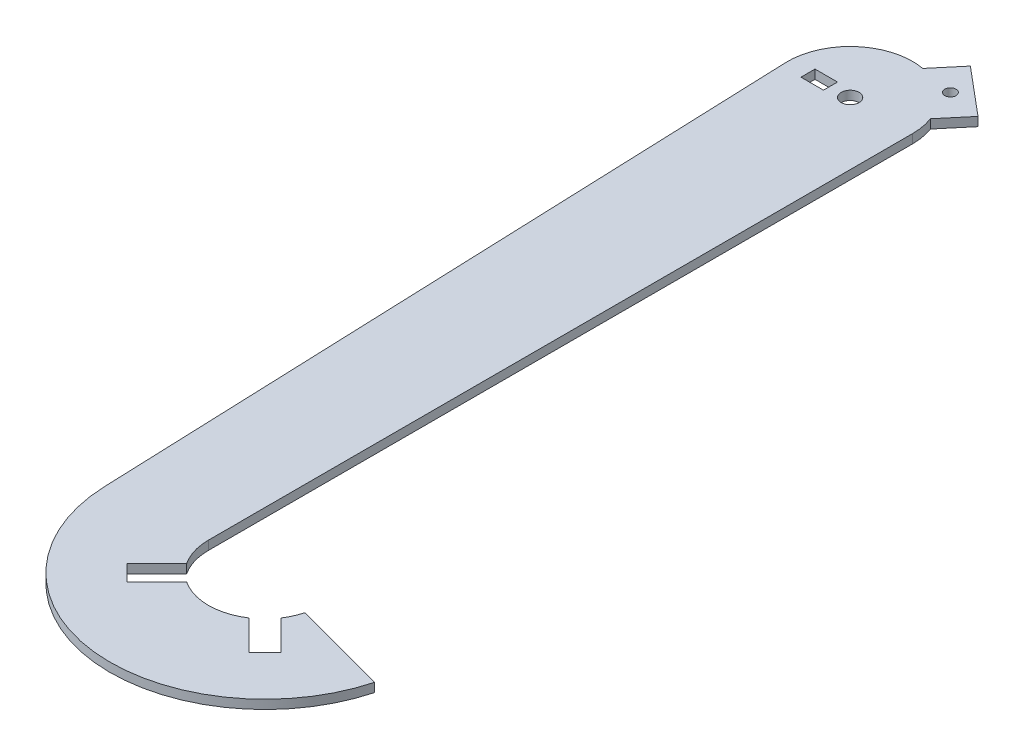
ISO-10303-21;
HEADER;
FILE_DESCRIPTION(('STEP AP214'),'2;1');
FILE_NAME('part.step','',(''),(''),'','','');
FILE_SCHEMA(('AUTOMOTIVE_DESIGN { 1 0 10303 214 1 1 1 1 }'));
ENDSEC;
DATA;
#1=APPLICATION_CONTEXT('core data for automotive mechanical design processes');
#2=APPLICATION_PROTOCOL_DEFINITION('international standard','automotive_design',2000,#1);
#3=PRODUCT_CONTEXT('',#1,'mechanical');
#4=PRODUCT('Part','Part','',(#3));
#5=PRODUCT_RELATED_PRODUCT_CATEGORY('part','',(#4));
#6=PRODUCT_DEFINITION_FORMATION('','',#4);
#7=PRODUCT_DEFINITION_CONTEXT('part definition',#1,'design');
#8=PRODUCT_DEFINITION('design','',#6,#7);
#9=PRODUCT_DEFINITION_SHAPE('','',#8);
#10=(LENGTH_UNIT() NAMED_UNIT(*) SI_UNIT(.MILLI.,.METRE.));
#11=(NAMED_UNIT(*) PLANE_ANGLE_UNIT() SI_UNIT($,.RADIAN.));
#12=(NAMED_UNIT(*) SI_UNIT($,.STERADIAN.) SOLID_ANGLE_UNIT());
#13=UNCERTAINTY_MEASURE_WITH_UNIT(LENGTH_MEASURE(1.E-05),#10,'distance_accuracy_value','');
#14=(GEOMETRIC_REPRESENTATION_CONTEXT(3) GLOBAL_UNCERTAINTY_ASSIGNED_CONTEXT((#13)) GLOBAL_UNIT_ASSIGNED_CONTEXT((#10,
#11,#12)) REPRESENTATION_CONTEXT('',''));
#15=CARTESIAN_POINT('',(0.,0.,0.));
#16=DIRECTION('',(0.,0.,1.));
#17=DIRECTION('',(1.,0.,0.));
#18=AXIS2_PLACEMENT_3D('',#15,#16,#17);
#19=CARTESIAN_POINT('',(0.,1.5875,0.));
#20=DIRECTION('',(0.,-1.,0.));
#21=DIRECTION('',(0.,0.,-1.));
#22=AXIS2_PLACEMENT_3D('',#19,#20,#21);
#23=PLANE('',#22);
#24=CARTESIAN_POINT('',(16.2701947262123,1.5875,-19.3900630171709));
#25=DIRECTION('',(0.,1.,0.));
#26=DIRECTION('',(0.,0.,1.));
#27=AXIS2_PLACEMENT_3D('',#24,#25,#26);
#28=CIRCLE('',#27,2.);
#29=CARTESIAN_POINT('',(16.2701947262123,1.5875,-17.3900630171709));
#30=VERTEX_POINT('',#29);
#31=EDGE_CURVE('E224',#30,#30,#28,.T.);
#32=ORIENTED_EDGE('',*,*,#31,.F.);
#33=EDGE_LOOP('',(#32));
#34=FACE_BOUND('',#33,.T.);
#35=CARTESIAN_POINT('',(0.,1.5875,0.));
#36=DIRECTION('',(0.,1.,0.));
#37=DIRECTION('',(0.,0.,1.));
#38=AXIS2_PLACEMENT_3D('',#35,#36,#37);
#39=CIRCLE('',#38,3.175);
#40=CARTESIAN_POINT('',(0.,1.5875,3.175));
#41=VERTEX_POINT('',#40);
#42=EDGE_CURVE('E230',#41,#41,#39,.T.);
#43=ORIENTED_EDGE('',*,*,#42,.F.);
#44=EDGE_LOOP('',(#43));
#45=FACE_BOUND('',#44,.T.);
#46=CARTESIAN_POINT('',(0.,1.5875,0.));
#47=DIRECTION('',(0.,1.,0.));
#48=DIRECTION('',(0.,0.,-1.));
#49=AXIS2_PLACEMENT_3D('',#46,#47,#48);
#50=CIRCLE('',#49,22.225);
#51=CARTESIAN_POINT('',(22.225,1.5875,0.));
#52=VERTEX_POINT('',#51);
#53=CARTESIAN_POINT('',(20.8399579424018,1.5875,-7.72313265190513));
#54=VERTEX_POINT('',#53);
#55=EDGE_CURVE('E236',#52,#54,#50,.T.);
#56=ORIENTED_EDGE('',*,*,#55,.T.);
#57=DIRECTION('',(0.642787609686538,0.,-0.766044443118979));
#58=VECTOR('',#57,1.);
#59=CARTESIAN_POINT('',(20.8399579424018,1.5875,-7.72313265190513));
#60=LINE('',#59,#58);
#61=CARTESIAN_POINT('',(28.5534092586403,1.5875,-16.9156659693329));
#62=VERTEX_POINT('',#61);
#63=EDGE_CURVE('E239',#54,#62,#60,.T.);
#64=ORIENTED_EDGE('',*,*,#63,.T.);
#65=DIRECTION('',(-0.766044443118979,0.,-0.642787609686538));
#66=VECTOR('',#65,1.);
#67=CARTESIAN_POINT('',(28.5534092586403,1.5875,-16.9156659693329));
#68=LINE('',#67,#66);
#69=CARTESIAN_POINT('',(11.7004315100227,1.5875,-31.0569933824367));
#70=VERTEX_POINT('',#69);
#71=EDGE_CURVE('E242',#62,#70,#68,.T.);
#72=ORIENTED_EDGE('',*,*,#71,.T.);
#73=DIRECTION('',(-0.642787609686538,0.,0.766044443118979));
#74=VECTOR('',#73,1.);
#75=CARTESIAN_POINT('',(11.7004315100227,1.5875,-31.0569933824367));
#76=LINE('',#75,#74);
#77=CARTESIAN_POINT('',(3.98698019378428,1.5875,-21.864460065009));
#78=VERTEX_POINT('',#77);
#79=EDGE_CURVE('E244',#70,#78,#76,.T.);
#80=ORIENTED_EDGE('',*,*,#79,.T.);
#81=CARTESIAN_POINT('',(0.,1.5875,0.));
#82=DIRECTION('',(0.,1.,0.));
#83=DIRECTION('',(0.,0.,-1.));
#84=AXIS2_PLACEMENT_3D('',#81,#82,#83);
#85=CIRCLE('',#84,22.225);
#86=CARTESIAN_POINT('',(-22.2092733910129,1.5875,0.835942846878908));
#87=VERTEX_POINT('',#86);
#88=EDGE_CURVE('E246',#78,#87,#85,.T.);
#89=ORIENTED_EDGE('',*,*,#88,.T.);
#90=DIRECTION('',(0.0376127265187356,0.,0.999292391046698));
#91=VECTOR('',#90,1.);
#92=CARTESIAN_POINT('',(-22.2092733910129,1.5875,0.835942846878897));
#93=LINE('',#92,#91);
#94=CARTESIAN_POINT('',(-12.7360093385657,1.5875,252.520985707869));
#95=VERTEX_POINT('',#94);
#96=EDGE_CURVE('E248',#87,#95,#93,.T.);
#97=ORIENTED_EDGE('',*,*,#96,.T.);
#98=CARTESIAN_POINT('',(42.3269899512462,1.5875,250.448449629194));
#99=DIRECTION('',(0.,1.,0.));
#100=DIRECTION('',(0.,0.,1.));
#101=AXIS2_PLACEMENT_3D('',#98,#99,#100);
#102=CIRCLE('',#101,55.1019899512461);
#103=CARTESIAN_POINT('',(95.5514251250757,1.5875,264.709894051624));
#104=VERTEX_POINT('',#103);
#105=EDGE_CURVE('E250',#95,#104,#102,.T.);
#106=ORIENTED_EDGE('',*,*,#105,.T.);
#107=DIRECTION('',(-0.965925826289071,0.,-0.258819045102512));
#108=VECTOR('',#107,1.);
#109=CARTESIAN_POINT('',(61.7440212049582,1.5875,255.651227473036));
#110=LINE('',#109,#108);
#111=CARTESIAN_POINT('',(61.7440212049582,1.5875,255.651227473036));
#112=VERTEX_POINT('',#111);
#113=EDGE_CURVE('E252',#104,#112,#110,.T.);
#114=ORIENTED_EDGE('',*,*,#113,.T.);
#115=CARTESIAN_POINT('',(42.3269899512462,1.5875,250.448449629194));
#116=DIRECTION('',(0.,-1.,0.));
#117=DIRECTION('',(0.,0.,1.));
#118=AXIS2_PLACEMENT_3D('',#115,#116,#117);
#119=CIRCLE('',#118,20.1019899512462);
#120=CARTESIAN_POINT('',(59.0854206653674,1.5875,261.550026093823));
#121=VERTEX_POINT('',#120);
#122=EDGE_CURVE('E254',#112,#121,#119,.T.);
#123=ORIENTED_EDGE('',*,*,#122,.T.);
#124=DIRECTION('',(0.707106781186541,0.,0.707106781186554));
#125=VECTOR('',#124,1.);
#126=CARTESIAN_POINT('',(69.6920223831655,1.5875,272.156627811622));
#127=LINE('',#126,#125);
#128=CARTESIAN_POINT('',(69.6920223831655,1.5875,272.156627811622));
#129=VERTEX_POINT('',#128);
#130=EDGE_CURVE('E256',#121,#129,#127,.T.);
#131=ORIENTED_EDGE('',*,*,#130,.T.);
#132=DIRECTION('',(-0.707106781186554,0.,0.70710678118654));
#133=VECTOR('',#132,1.);
#134=CARTESIAN_POINT('',(64.0351681336731,1.5875,277.813482061114));
#135=LINE('',#134,#133);
#136=CARTESIAN_POINT('',(64.0351681336731,1.5875,277.813482061114));
#137=VERTEX_POINT('',#136);
#138=EDGE_CURVE('E258',#129,#137,#135,.T.);
#139=ORIENTED_EDGE('',*,*,#138,.T.);
#140=DIRECTION('',(-0.707106781186544,0.,-0.707106781186551));
#141=VECTOR('',#140,1.);
#142=CARTESIAN_POINT('',(53.4285664158749,1.5875,267.206880343316));
#143=LINE('',#142,#141);
#144=CARTESIAN_POINT('',(53.4285664158749,1.5875,267.206880343316));
#145=VERTEX_POINT('',#144);
#146=EDGE_CURVE('E260',#137,#145,#143,.T.);
#147=ORIENTED_EDGE('',*,*,#146,.T.);
#148=CARTESIAN_POINT('',(42.3269899512462,1.5875,250.448449629194));
#149=DIRECTION('',(0.,-1.,0.));
#150=DIRECTION('',(0.,0.,1.));
#151=AXIS2_PLACEMENT_3D('',#148,#149,#150);
#152=CIRCLE('',#151,20.1019899512462);
#153=CARTESIAN_POINT('',(31.2254134866174,1.5875,267.206880343316));
#154=VERTEX_POINT('',#153);
#155=EDGE_CURVE('E262',#145,#154,#152,.T.);
#156=ORIENTED_EDGE('',*,*,#155,.T.);
#157=DIRECTION('',(-0.707106781186544,0.,0.707106781186551));
#158=VECTOR('',#157,1.);
#159=CARTESIAN_POINT('',(20.6188117688193,1.5875,277.813482061114));
#160=LINE('',#159,#158);
#161=CARTESIAN_POINT('',(20.6188117688193,1.5875,277.813482061114));
#162=VERTEX_POINT('',#161);
#163=EDGE_CURVE('E264',#154,#162,#160,.T.);
#164=ORIENTED_EDGE('',*,*,#163,.T.);
#165=DIRECTION('',(-0.707106781186555,0.,-0.70710678118654));
#166=VECTOR('',#165,1.);
#167=CARTESIAN_POINT('',(14.9619575193269,1.5875,272.156627811622));
#168=LINE('',#167,#166);
#169=CARTESIAN_POINT('',(14.9619575193269,1.5875,272.156627811622));
#170=VERTEX_POINT('',#169);
#171=EDGE_CURVE('E266',#162,#170,#168,.T.);
#172=ORIENTED_EDGE('',*,*,#171,.T.);
#173=DIRECTION('',(0.707106781186543,0.,-0.707106781186552));
#174=VECTOR('',#173,1.);
#175=CARTESIAN_POINT('',(25.568559237125,1.5875,261.550026093823));
#176=LINE('',#175,#174);
#177=CARTESIAN_POINT('',(25.568559237125,1.5875,261.550026093823));
#178=VERTEX_POINT('',#177);
#179=EDGE_CURVE('E268',#170,#178,#176,.T.);
#180=ORIENTED_EDGE('',*,*,#179,.T.);
#181=CARTESIAN_POINT('',(42.3269899512462,1.5875,250.448449629194));
#182=DIRECTION('',(0.,-1.,0.));
#183=DIRECTION('',(0.,0.,1.));
#184=AXIS2_PLACEMENT_3D('',#181,#182,#183);
#185=CIRCLE('',#184,20.1019899512462);
#186=CARTESIAN_POINT('',(22.225,1.5875,250.448449629194));
#187=VERTEX_POINT('',#186);
#188=EDGE_CURVE('E270',#178,#187,#185,.T.);
#189=ORIENTED_EDGE('',*,*,#188,.T.);
#190=DIRECTION('',(0.,0.,-1.));
#191=VECTOR('',#190,1.);
#192=CARTESIAN_POINT('',(22.225,1.5875,0.));
#193=LINE('',#192,#191);
#194=EDGE_CURVE('E272',#187,#52,#193,.T.);
#195=ORIENTED_EDGE('',*,*,#194,.T.);
#196=EDGE_LOOP('',(#56,#64,#72,#80,#89,#97,#106,#114,#123,#131,#139,#147,#156,#164,#172,#180,
#189,#195));
#197=FACE_BOUND('',#196,.T.);
#198=DIRECTION('',(0.,0.,1.));
#199=VECTOR('',#198,1.);
#200=CARTESIAN_POINT('',(-15.,1.5875,-2.5));
#201=LINE('',#200,#199);
#202=CARTESIAN_POINT('',(-15.,1.5875,-2.5));
#203=VERTEX_POINT('',#202);
#204=CARTESIAN_POINT('',(-15.,1.5875,2.5));
#205=VERTEX_POINT('',#204);
#206=EDGE_CURVE('E188',#203,#205,#201,.T.);
#207=ORIENTED_EDGE('',*,*,#206,.F.);
#208=DIRECTION('',(-1.,0.,0.));
#209=VECTOR('',#208,1.);
#210=CARTESIAN_POINT('',(-15.,1.5875,-2.5));
#211=LINE('',#210,#209);
#212=CARTESIAN_POINT('',(-7.,1.5875,-2.5));
#213=VERTEX_POINT('',#212);
#214=EDGE_CURVE('E210',#213,#203,#211,.T.);
#215=ORIENTED_EDGE('',*,*,#214,.F.);
#216=DIRECTION('',(0.,0.,-1.));
#217=VECTOR('',#216,1.);
#218=CARTESIAN_POINT('',(-7.,1.5875,-2.5));
#219=LINE('',#218,#217);
#220=CARTESIAN_POINT('',(-7.,1.5875,2.5));
#221=VERTEX_POINT('',#220);
#222=EDGE_CURVE('E208',#221,#213,#219,.T.);
#223=ORIENTED_EDGE('',*,*,#222,.F.);
#224=DIRECTION('',(1.,0.,0.));
#225=VECTOR('',#224,1.);
#226=CARTESIAN_POINT('',(-15.,1.5875,2.5));
#227=LINE('',#226,#225);
#228=EDGE_CURVE('E196',#205,#221,#227,.T.);
#229=ORIENTED_EDGE('',*,*,#228,.F.);
#230=EDGE_LOOP('',(#207,#215,#223,#229));
#231=FACE_BOUND('',#230,.T.);
#232=ADVANCED_FACE('F39',(#34,#45,#197,#231),#23,.F.);
#233=CARTESIAN_POINT('',(0.,-1.5875,0.));
#234=DIRECTION('',(0.,-1.,0.));
#235=DIRECTION('',(0.,0.,-1.));
#236=AXIS2_PLACEMENT_3D('',#233,#234,#235);
#237=PLANE('',#236);
#238=CARTESIAN_POINT('',(0.,-1.5875,0.));
#239=DIRECTION('',(0.,1.,0.));
#240=DIRECTION('',(0.,0.,1.));
#241=AXIS2_PLACEMENT_3D('',#238,#239,#240);
#242=CIRCLE('',#241,3.175);
#243=CARTESIAN_POINT('',(0.,-1.5875,3.175));
#244=VERTEX_POINT('',#243);
#245=EDGE_CURVE('E227',#244,#244,#242,.T.);
#246=ORIENTED_EDGE('',*,*,#245,.T.);
#247=EDGE_LOOP('',(#246));
#248=FACE_BOUND('',#247,.T.);
#249=CARTESIAN_POINT('',(0.,-1.5875,0.));
#250=DIRECTION('',(0.,1.,0.));
#251=DIRECTION('',(0.,0.,-1.));
#252=AXIS2_PLACEMENT_3D('',#249,#250,#251);
#253=CIRCLE('',#252,22.225);
#254=CARTESIAN_POINT('',(22.225,-1.5875,0.));
#255=VERTEX_POINT('',#254);
#256=CARTESIAN_POINT('',(20.8399579424018,-1.5875,-7.72313265190513));
#257=VERTEX_POINT('',#256);
#258=EDGE_CURVE('E233',#255,#257,#253,.T.);
#259=ORIENTED_EDGE('',*,*,#258,.F.);
#260=DIRECTION('',(0.,0.,-1.));
#261=VECTOR('',#260,1.);
#262=CARTESIAN_POINT('',(22.225,-1.5875,0.));
#263=LINE('',#262,#261);
#264=CARTESIAN_POINT('',(22.225,-1.5875,250.448449629194));
#265=VERTEX_POINT('',#264);
#266=EDGE_CURVE('E240',#265,#255,#263,.T.);
#267=ORIENTED_EDGE('',*,*,#266,.F.);
#268=CARTESIAN_POINT('',(42.3269899512462,-1.5875,250.448449629194));
#269=DIRECTION('',(0.,-1.,0.));
#270=DIRECTION('',(0.,0.,1.));
#271=AXIS2_PLACEMENT_3D('',#268,#269,#270);
#272=CIRCLE('',#271,20.1019899512462);
#273=CARTESIAN_POINT('',(25.568559237125,-1.5875,261.550026093823));
#274=VERTEX_POINT('',#273);
#275=EDGE_CURVE('E307',#274,#265,#272,.T.);
#276=ORIENTED_EDGE('',*,*,#275,.F.);
#277=DIRECTION('',(0.707106781186543,0.,-0.707106781186552));
#278=VECTOR('',#277,1.);
#279=CARTESIAN_POINT('',(25.568559237125,-1.5875,261.550026093823));
#280=LINE('',#279,#278);
#281=CARTESIAN_POINT('',(14.9619575193269,-1.5875,272.156627811622));
#282=VERTEX_POINT('',#281);
#283=EDGE_CURVE('E305',#282,#274,#280,.T.);
#284=ORIENTED_EDGE('',*,*,#283,.F.);
#285=DIRECTION('',(-0.707106781186555,0.,-0.70710678118654));
#286=VECTOR('',#285,1.);
#287=CARTESIAN_POINT('',(14.9619575193269,-1.5875,272.156627811622));
#288=LINE('',#287,#286);
#289=CARTESIAN_POINT('',(20.6188117688193,-1.5875,277.813482061114));
#290=VERTEX_POINT('',#289);
#291=EDGE_CURVE('E303',#290,#282,#288,.T.);
#292=ORIENTED_EDGE('',*,*,#291,.F.);
#293=DIRECTION('',(-0.707106781186544,0.,0.707106781186551));
#294=VECTOR('',#293,1.);
#295=CARTESIAN_POINT('',(20.6188117688193,-1.5875,277.813482061114));
#296=LINE('',#295,#294);
#297=CARTESIAN_POINT('',(31.2254134866174,-1.5875,267.206880343316));
#298=VERTEX_POINT('',#297);
#299=EDGE_CURVE('E301',#298,#290,#296,.T.);
#300=ORIENTED_EDGE('',*,*,#299,.F.);
#301=CARTESIAN_POINT('',(42.3269899512462,-1.5875,250.448449629194));
#302=DIRECTION('',(0.,-1.,0.));
#303=DIRECTION('',(0.,0.,1.));
#304=AXIS2_PLACEMENT_3D('',#301,#302,#303);
#305=CIRCLE('',#304,20.1019899512462);
#306=CARTESIAN_POINT('',(53.4285664158749,-1.5875,267.206880343316));
#307=VERTEX_POINT('',#306);
#308=EDGE_CURVE('E299',#307,#298,#305,.T.);
#309=ORIENTED_EDGE('',*,*,#308,.F.);
#310=DIRECTION('',(-0.707106781186544,0.,-0.707106781186551));
#311=VECTOR('',#310,1.);
#312=CARTESIAN_POINT('',(53.4285664158749,-1.5875,267.206880343316));
#313=LINE('',#312,#311);
#314=CARTESIAN_POINT('',(64.0351681336731,-1.5875,277.813482061114));
#315=VERTEX_POINT('',#314);
#316=EDGE_CURVE('E297',#315,#307,#313,.T.);
#317=ORIENTED_EDGE('',*,*,#316,.F.);
#318=DIRECTION('',(-0.707106781186554,0.,0.70710678118654));
#319=VECTOR('',#318,1.);
#320=CARTESIAN_POINT('',(64.0351681336731,-1.5875,277.813482061114));
#321=LINE('',#320,#319);
#322=CARTESIAN_POINT('',(69.6920223831655,-1.5875,272.156627811622));
#323=VERTEX_POINT('',#322);
#324=EDGE_CURVE('E295',#323,#315,#321,.T.);
#325=ORIENTED_EDGE('',*,*,#324,.F.);
#326=DIRECTION('',(0.707106781186541,0.,0.707106781186554));
#327=VECTOR('',#326,1.);
#328=CARTESIAN_POINT('',(69.6920223831655,-1.5875,272.156627811622));
#329=LINE('',#328,#327);
#330=CARTESIAN_POINT('',(59.0854206653674,-1.5875,261.550026093823));
#331=VERTEX_POINT('',#330);
#332=EDGE_CURVE('E293',#331,#323,#329,.T.);
#333=ORIENTED_EDGE('',*,*,#332,.F.);
#334=CARTESIAN_POINT('',(42.3269899512462,-1.5875,250.448449629194));
#335=DIRECTION('',(0.,-1.,0.));
#336=DIRECTION('',(0.,0.,1.));
#337=AXIS2_PLACEMENT_3D('',#334,#335,#336);
#338=CIRCLE('',#337,20.1019899512462);
#339=CARTESIAN_POINT('',(61.7440212049582,-1.5875,255.651227473036));
#340=VERTEX_POINT('',#339);
#341=EDGE_CURVE('E291',#340,#331,#338,.T.);
#342=ORIENTED_EDGE('',*,*,#341,.F.);
#343=DIRECTION('',(-0.965925826289071,0.,-0.258819045102512));
#344=VECTOR('',#343,1.);
#345=CARTESIAN_POINT('',(61.7440212049582,-1.5875,255.651227473036));
#346=LINE('',#345,#344);
#347=CARTESIAN_POINT('',(95.5514251250757,-1.5875,264.709894051624));
#348=VERTEX_POINT('',#347);
#349=EDGE_CURVE('E289',#348,#340,#346,.T.);
#350=ORIENTED_EDGE('',*,*,#349,.F.);
#351=CARTESIAN_POINT('',(42.3269899512462,-1.5875,250.448449629194));
#352=DIRECTION('',(0.,1.,0.));
#353=DIRECTION('',(0.,0.,1.));
#354=AXIS2_PLACEMENT_3D('',#351,#352,#353);
#355=CIRCLE('',#354,55.1019899512461);
#356=CARTESIAN_POINT('',(-12.7360093385657,-1.5875,252.520985707869));
#357=VERTEX_POINT('',#356);
#358=EDGE_CURVE('E287',#357,#348,#355,.T.);
#359=ORIENTED_EDGE('',*,*,#358,.F.);
#360=DIRECTION('',(0.0376127265187356,0.,0.999292391046698));
#361=VECTOR('',#360,1.);
#362=CARTESIAN_POINT('',(-22.2092733910129,-1.5875,0.835942846878897));
#363=LINE('',#362,#361);
#364=CARTESIAN_POINT('',(-22.2092733910129,-1.5875,0.835942846878908));
#365=VERTEX_POINT('',#364);
#366=EDGE_CURVE('E285',#365,#357,#363,.T.);
#367=ORIENTED_EDGE('',*,*,#366,.F.);
#368=CARTESIAN_POINT('',(0.,-1.5875,0.));
#369=DIRECTION('',(0.,1.,0.));
#370=DIRECTION('',(0.,0.,-1.));
#371=AXIS2_PLACEMENT_3D('',#368,#369,#370);
#372=CIRCLE('',#371,22.225);
#373=CARTESIAN_POINT('',(3.98698019378428,-1.5875,-21.864460065009));
#374=VERTEX_POINT('',#373);
#375=EDGE_CURVE('E283',#374,#365,#372,.T.);
#376=ORIENTED_EDGE('',*,*,#375,.F.);
#377=DIRECTION('',(-0.642787609686538,0.,0.766044443118979));
#378=VECTOR('',#377,1.);
#379=CARTESIAN_POINT('',(11.7004315100227,-1.5875,-31.0569933824367));
#380=LINE('',#379,#378);
#381=CARTESIAN_POINT('',(11.7004315100227,-1.5875,-31.0569933824367));
#382=VERTEX_POINT('',#381);
#383=EDGE_CURVE('E281',#382,#374,#380,.T.);
#384=ORIENTED_EDGE('',*,*,#383,.F.);
#385=DIRECTION('',(-0.766044443118979,0.,-0.642787609686538));
#386=VECTOR('',#385,1.);
#387=CARTESIAN_POINT('',(28.5534092586403,-1.5875,-16.9156659693329));
#388=LINE('',#387,#386);
#389=CARTESIAN_POINT('',(28.5534092586403,-1.5875,-16.9156659693329));
#390=VERTEX_POINT('',#389);
#391=EDGE_CURVE('E279',#390,#382,#388,.T.);
#392=ORIENTED_EDGE('',*,*,#391,.F.);
#393=DIRECTION('',(0.642787609686538,0.,-0.766044443118979));
#394=VECTOR('',#393,1.);
#395=CARTESIAN_POINT('',(20.8399579424018,-1.5875,-7.72313265190513));
#396=LINE('',#395,#394);
#397=EDGE_CURVE('E277',#257,#390,#396,.T.);
#398=ORIENTED_EDGE('',*,*,#397,.F.);
#399=EDGE_LOOP('',(#259,#267,#276,#284,#292,#300,#309,#317,#325,#333,#342,#350,#359,#367,#376,
#384,#392,#398));
#400=FACE_BOUND('',#399,.T.);
#401=CARTESIAN_POINT('',(16.2701947262123,-1.5875,-19.3900630171709));
#402=DIRECTION('',(0.,1.,0.));
#403=DIRECTION('',(0.,0.,1.));
#404=AXIS2_PLACEMENT_3D('',#401,#402,#403);
#405=CIRCLE('',#404,2.);
#406=CARTESIAN_POINT('',(16.2701947262123,-1.5875,-17.3900630171709));
#407=VERTEX_POINT('',#406);
#408=EDGE_CURVE('E204',#407,#407,#405,.T.);
#409=ORIENTED_EDGE('',*,*,#408,.T.);
#410=EDGE_LOOP('',(#409));
#411=FACE_BOUND('',#410,.T.);
#412=DIRECTION('',(-1.,0.,0.));
#413=VECTOR('',#412,1.);
#414=CARTESIAN_POINT('',(-15.,-1.5875,-2.5));
#415=LINE('',#414,#413);
#416=CARTESIAN_POINT('',(-7.,-1.5875,-2.5));
#417=VERTEX_POINT('',#416);
#418=CARTESIAN_POINT('',(-15.,-1.5875,-2.5));
#419=VERTEX_POINT('',#418);
#420=EDGE_CURVE('E197',#417,#419,#415,.T.);
#421=ORIENTED_EDGE('',*,*,#420,.T.);
#422=DIRECTION('',(0.,0.,1.));
#423=VECTOR('',#422,1.);
#424=CARTESIAN_POINT('',(-15.,-1.5875,-2.5));
#425=LINE('',#424,#423);
#426=CARTESIAN_POINT('',(-15.,-1.5875,2.5));
#427=VERTEX_POINT('',#426);
#428=EDGE_CURVE('E62',#419,#427,#425,.T.);
#429=ORIENTED_EDGE('',*,*,#428,.T.);
#430=DIRECTION('',(1.,0.,0.));
#431=VECTOR('',#430,1.);
#432=CARTESIAN_POINT('',(-15.,-1.5875,2.5));
#433=LINE('',#432,#431);
#434=CARTESIAN_POINT('',(-7.,-1.5875,2.5));
#435=VERTEX_POINT('',#434);
#436=EDGE_CURVE('E203',#427,#435,#433,.T.);
#437=ORIENTED_EDGE('',*,*,#436,.T.);
#438=DIRECTION('',(0.,0.,-1.));
#439=VECTOR('',#438,1.);
#440=CARTESIAN_POINT('',(-7.,-1.5875,-2.5));
#441=LINE('',#440,#439);
#442=EDGE_CURVE('E216',#435,#417,#441,.T.);
#443=ORIENTED_EDGE('',*,*,#442,.T.);
#444=EDGE_LOOP('',(#421,#429,#437,#443));
#445=FACE_BOUND('',#444,.T.);
#446=ADVANCED_FACE('F367',(#248,#400,#411,#445),#237,.T.);
#447=CARTESIAN_POINT('',(0.,1.5875,0.));
#448=DIRECTION('',(0.,-1.,0.));
#449=DIRECTION('',(0.,0.,-1.));
#450=AXIS2_PLACEMENT_3D('',#447,#448,#449);
#451=CYLINDRICAL_SURFACE('',#450,22.225);
#452=ORIENTED_EDGE('',*,*,#258,.T.);
#453=DIRECTION('',(0.,-1.,0.));
#454=VECTOR('',#453,1.);
#455=CARTESIAN_POINT('',(20.8399579424018,1.5875,-7.72313265190513));
#456=LINE('',#455,#454);
#457=EDGE_CURVE('E11',#54,#257,#456,.T.);
#458=ORIENTED_EDGE('',*,*,#457,.F.);
#459=ORIENTED_EDGE('',*,*,#55,.F.);
#460=DIRECTION('',(0.,-1.,0.));
#461=VECTOR('',#460,1.);
#462=CARTESIAN_POINT('',(22.225,1.5875,0.));
#463=LINE('',#462,#461);
#464=EDGE_CURVE('E274',#52,#255,#463,.T.);
#465=ORIENTED_EDGE('',*,*,#464,.T.);
#466=EDGE_LOOP('',(#452,#458,#459,#465));
#467=FACE_BOUND('',#466,.T.);
#468=ADVANCED_FACE('F41',(#467),#451,.T.);
#469=CARTESIAN_POINT('',(20.8399579424018,1.5875,-7.72313265190513));
#470=DIRECTION('',(-0.766044443118979,0.,-0.642787609686538));
#471=DIRECTION('',(-0.642787609686538,0.,0.766044443118979));
#472=AXIS2_PLACEMENT_3D('',#469,#470,#471);
#473=PLANE('',#472);
#474=ORIENTED_EDGE('',*,*,#397,.T.);
#475=DIRECTION('',(0.,-1.,0.));
#476=VECTOR('',#475,1.);
#477=CARTESIAN_POINT('',(28.5534092586403,1.5875,-16.9156659693329));
#478=LINE('',#477,#476);
#479=EDGE_CURVE('E47',#62,#390,#478,.T.);
#480=ORIENTED_EDGE('',*,*,#479,.F.);
#481=ORIENTED_EDGE('',*,*,#63,.F.);
#482=ORIENTED_EDGE('',*,*,#457,.T.);
#483=EDGE_LOOP('',(#474,#480,#481,#482));
#484=FACE_BOUND('',#483,.T.);
#485=ADVANCED_FACE('F384',(#484),#473,.F.);
#486=CARTESIAN_POINT('',(28.5534092586403,1.5875,-16.9156659693329));
#487=DIRECTION('',(-0.642787609686538,0.,0.766044443118979));
#488=DIRECTION('',(0.766044443118979,0.,0.642787609686538));
#489=AXIS2_PLACEMENT_3D('',#486,#487,#488);
#490=PLANE('',#489);
#491=ORIENTED_EDGE('',*,*,#391,.T.);
#492=DIRECTION('',(0.,-1.,0.));
#493=VECTOR('',#492,1.);
#494=CARTESIAN_POINT('',(11.7004315100227,1.5875,-31.0569933824367));
#495=LINE('',#494,#493);
#496=EDGE_CURVE('E354',#70,#382,#495,.T.);
#497=ORIENTED_EDGE('',*,*,#496,.F.);
#498=ORIENTED_EDGE('',*,*,#71,.F.);
#499=ORIENTED_EDGE('',*,*,#479,.T.);
#500=EDGE_LOOP('',(#491,#497,#498,#499));
#501=FACE_BOUND('',#500,.T.);
#502=ADVANCED_FACE('F361',(#501),#490,.F.);
#503=CARTESIAN_POINT('',(11.7004315100227,1.5875,-31.0569933824367));
#504=DIRECTION('',(0.766044443118979,0.,0.642787609686538));
#505=DIRECTION('',(0.642787609686538,0.,-0.766044443118979));
#506=AXIS2_PLACEMENT_3D('',#503,#504,#505);
#507=PLANE('',#506);
#508=ORIENTED_EDGE('',*,*,#383,.T.);
#509=DIRECTION('',(0.,-1.,0.));
#510=VECTOR('',#509,1.);
#511=CARTESIAN_POINT('',(3.98698019378428,1.5875,-21.864460065009));
#512=LINE('',#511,#510);
#513=EDGE_CURVE('E351',#78,#374,#512,.T.);
#514=ORIENTED_EDGE('',*,*,#513,.F.);
#515=ORIENTED_EDGE('',*,*,#79,.F.);
#516=ORIENTED_EDGE('',*,*,#496,.T.);
#517=EDGE_LOOP('',(#508,#514,#515,#516));
#518=FACE_BOUND('',#517,.T.);
#519=ADVANCED_FACE('F373',(#518),#507,.F.);
#520=CARTESIAN_POINT('',(0.,1.5875,0.));
#521=DIRECTION('',(0.,-1.,0.));
#522=DIRECTION('',(0.,0.,-1.));
#523=AXIS2_PLACEMENT_3D('',#520,#521,#522);
#524=CYLINDRICAL_SURFACE('',#523,22.225);
#525=ORIENTED_EDGE('',*,*,#375,.T.);
#526=DIRECTION('',(0.,-1.,0.));
#527=VECTOR('',#526,1.);
#528=CARTESIAN_POINT('',(-22.2092733910129,1.5875,0.835942846878908));
#529=LINE('',#528,#527);
#530=EDGE_CURVE('E348',#87,#365,#529,.T.);
#531=ORIENTED_EDGE('',*,*,#530,.F.);
#532=ORIENTED_EDGE('',*,*,#88,.F.);
#533=ORIENTED_EDGE('',*,*,#513,.T.);
#534=EDGE_LOOP('',(#525,#531,#532,#533));
#535=FACE_BOUND('',#534,.T.);
#536=ADVANCED_FACE('F377',(#535),#524,.T.);
#537=CARTESIAN_POINT('',(-22.2092733910129,1.5875,0.835942846878897));
#538=DIRECTION('',(0.999292391046698,0.,-0.0376127265187356));
#539=DIRECTION('',(-0.0376127265187356,0.,-0.999292391046698));
#540=AXIS2_PLACEMENT_3D('',#537,#538,#539);
#541=PLANE('',#540);
#542=ORIENTED_EDGE('',*,*,#366,.T.);
#543=DIRECTION('',(0.,-1.,0.));
#544=VECTOR('',#543,1.);
#545=CARTESIAN_POINT('',(-12.7360093385657,1.5875,252.520985707869));
#546=LINE('',#545,#544);
#547=EDGE_CURVE('E345',#95,#357,#546,.T.);
#548=ORIENTED_EDGE('',*,*,#547,.F.);
#549=ORIENTED_EDGE('',*,*,#96,.F.);
#550=ORIENTED_EDGE('',*,*,#530,.T.);
#551=EDGE_LOOP('',(#542,#548,#549,#550));
#552=FACE_BOUND('',#551,.T.);
#553=ADVANCED_FACE('F447',(#552),#541,.F.);
#554=CARTESIAN_POINT('',(42.3269899512462,1.5875,250.448449629194));
#555=DIRECTION('',(0.,-1.,0.));
#556=DIRECTION('',(0.,0.,-1.));
#557=AXIS2_PLACEMENT_3D('',#554,#555,#556);
#558=CYLINDRICAL_SURFACE('',#557,55.1019899512461);
#559=ORIENTED_EDGE('',*,*,#358,.T.);
#560=DIRECTION('',(0.,-1.,0.));
#561=VECTOR('',#560,1.);
#562=CARTESIAN_POINT('',(95.5514251250757,1.5875,264.709894051624));
#563=LINE('',#562,#561);
#564=EDGE_CURVE('E342',#104,#348,#563,.T.);
#565=ORIENTED_EDGE('',*,*,#564,.F.);
#566=ORIENTED_EDGE('',*,*,#105,.F.);
#567=ORIENTED_EDGE('',*,*,#547,.T.);
#568=EDGE_LOOP('',(#559,#565,#566,#567));
#569=FACE_BOUND('',#568,.T.);
#570=ADVANCED_FACE('F445',(#569),#558,.T.);
#571=CARTESIAN_POINT('',(61.7440212049582,1.5875,255.651227473036));
#572=DIRECTION('',(-0.258819045102512,0.,0.965925826289071));
#573=DIRECTION('',(0.965925826289071,0.,0.258819045102512));
#574=AXIS2_PLACEMENT_3D('',#571,#572,#573);
#575=PLANE('',#574);
#576=ORIENTED_EDGE('',*,*,#349,.T.);
#577=DIRECTION('',(0.,-1.,0.));
#578=VECTOR('',#577,1.);
#579=CARTESIAN_POINT('',(61.7440212049582,1.5875,255.651227473036));
#580=LINE('',#579,#578);
#581=EDGE_CURVE('E339',#112,#340,#580,.T.);
#582=ORIENTED_EDGE('',*,*,#581,.F.);
#583=ORIENTED_EDGE('',*,*,#113,.F.);
#584=ORIENTED_EDGE('',*,*,#564,.T.);
#585=EDGE_LOOP('',(#576,#582,#583,#584));
#586=FACE_BOUND('',#585,.T.);
#587=ADVANCED_FACE('F441',(#586),#575,.F.);
#588=CARTESIAN_POINT('',(42.3269899512462,1.5875,250.448449629194));
#589=DIRECTION('',(0.,-1.,0.));
#590=DIRECTION('',(0.,0.,-1.));
#591=AXIS2_PLACEMENT_3D('',#588,#589,#590);
#592=CYLINDRICAL_SURFACE('',#591,20.1019899512462);
#593=ORIENTED_EDGE('',*,*,#341,.T.);
#594=DIRECTION('',(0.,-1.,0.));
#595=VECTOR('',#594,1.);
#596=CARTESIAN_POINT('',(59.0854206653674,1.5875,261.550026093823));
#597=LINE('',#596,#595);
#598=EDGE_CURVE('E336',#121,#331,#597,.T.);
#599=ORIENTED_EDGE('',*,*,#598,.F.);
#600=ORIENTED_EDGE('',*,*,#122,.F.);
#601=ORIENTED_EDGE('',*,*,#581,.T.);
#602=EDGE_LOOP('',(#593,#599,#600,#601));
#603=FACE_BOUND('',#602,.T.);
#604=ADVANCED_FACE('F436',(#603),#592,.F.);
#605=CARTESIAN_POINT('',(69.6920223831655,1.5875,272.156627811622));
#606=DIRECTION('',(0.707106781186554,0.,-0.707106781186541));
#607=DIRECTION('',(-0.707106781186541,0.,-0.707106781186554));
#608=AXIS2_PLACEMENT_3D('',#605,#606,#607);
#609=PLANE('',#608);
#610=ORIENTED_EDGE('',*,*,#332,.T.);
#611=DIRECTION('',(0.,-1.,0.));
#612=VECTOR('',#611,1.);
#613=CARTESIAN_POINT('',(69.6920223831655,1.5875,272.156627811622));
#614=LINE('',#613,#612);
#615=EDGE_CURVE('E333',#129,#323,#614,.T.);
#616=ORIENTED_EDGE('',*,*,#615,.F.);
#617=ORIENTED_EDGE('',*,*,#130,.F.);
#618=ORIENTED_EDGE('',*,*,#598,.T.);
#619=EDGE_LOOP('',(#610,#616,#617,#618));
#620=FACE_BOUND('',#619,.T.);
#621=ADVANCED_FACE('F430',(#620),#609,.F.);
#622=CARTESIAN_POINT('',(64.0351681336731,1.5875,277.813482061114));
#623=DIRECTION('',(0.707106781186541,0.,0.707106781186554));
#624=DIRECTION('',(0.707106781186554,0.,-0.707106781186541));
#625=AXIS2_PLACEMENT_3D('',#622,#623,#624);
#626=PLANE('',#625);
#627=ORIENTED_EDGE('',*,*,#324,.T.);
#628=DIRECTION('',(0.,-1.,0.));
#629=VECTOR('',#628,1.);
#630=CARTESIAN_POINT('',(64.0351681336731,1.5875,277.813482061114));
#631=LINE('',#630,#629);
#632=EDGE_CURVE('E330',#137,#315,#631,.T.);
#633=ORIENTED_EDGE('',*,*,#632,.F.);
#634=ORIENTED_EDGE('',*,*,#138,.F.);
#635=ORIENTED_EDGE('',*,*,#615,.T.);
#636=EDGE_LOOP('',(#627,#633,#634,#635));
#637=FACE_BOUND('',#636,.T.);
#638=ADVANCED_FACE('F426',(#637),#626,.F.);
#639=CARTESIAN_POINT('',(53.4285664158749,1.5875,267.206880343316));
#640=DIRECTION('',(-0.707106781186551,0.,0.707106781186544));
#641=DIRECTION('',(0.707106781186544,0.,0.707106781186551));
#642=AXIS2_PLACEMENT_3D('',#639,#640,#641);
#643=PLANE('',#642);
#644=ORIENTED_EDGE('',*,*,#316,.T.);
#645=DIRECTION('',(0.,-1.,0.));
#646=VECTOR('',#645,1.);
#647=CARTESIAN_POINT('',(53.4285664158749,1.5875,267.206880343316));
#648=LINE('',#647,#646);
#649=EDGE_CURVE('E327',#145,#307,#648,.T.);
#650=ORIENTED_EDGE('',*,*,#649,.F.);
#651=ORIENTED_EDGE('',*,*,#146,.F.);
#652=ORIENTED_EDGE('',*,*,#632,.T.);
#653=EDGE_LOOP('',(#644,#650,#651,#652));
#654=FACE_BOUND('',#653,.T.);
#655=ADVANCED_FACE('F421',(#654),#643,.F.);
#656=CARTESIAN_POINT('',(42.3269899512462,1.5875,250.448449629194));
#657=DIRECTION('',(0.,-1.,0.));
#658=DIRECTION('',(0.,0.,-1.));
#659=AXIS2_PLACEMENT_3D('',#656,#657,#658);
#660=CYLINDRICAL_SURFACE('',#659,20.1019899512462);
#661=ORIENTED_EDGE('',*,*,#308,.T.);
#662=DIRECTION('',(0.,-1.,0.));
#663=VECTOR('',#662,1.);
#664=CARTESIAN_POINT('',(31.2254134866174,1.5875,267.206880343316));
#665=LINE('',#664,#663);
#666=EDGE_CURVE('E324',#154,#298,#665,.T.);
#667=ORIENTED_EDGE('',*,*,#666,.F.);
#668=ORIENTED_EDGE('',*,*,#155,.F.);
#669=ORIENTED_EDGE('',*,*,#649,.T.);
#670=EDGE_LOOP('',(#661,#667,#668,#669));
#671=FACE_BOUND('',#670,.T.);
#672=ADVANCED_FACE('F415',(#671),#660,.F.);
#673=CARTESIAN_POINT('',(20.6188117688193,1.5875,277.813482061114));
#674=DIRECTION('',(0.707106781186551,0.,0.707106781186544));
#675=DIRECTION('',(0.707106781186544,0.,-0.707106781186551));
#676=AXIS2_PLACEMENT_3D('',#673,#674,#675);
#677=PLANE('',#676);
#678=ORIENTED_EDGE('',*,*,#299,.T.);
#679=DIRECTION('',(0.,-1.,0.));
#680=VECTOR('',#679,1.);
#681=CARTESIAN_POINT('',(20.6188117688193,1.5875,277.813482061114));
#682=LINE('',#681,#680);
#683=EDGE_CURVE('E321',#162,#290,#682,.T.);
#684=ORIENTED_EDGE('',*,*,#683,.F.);
#685=ORIENTED_EDGE('',*,*,#163,.F.);
#686=ORIENTED_EDGE('',*,*,#666,.T.);
#687=EDGE_LOOP('',(#678,#684,#685,#686));
#688=FACE_BOUND('',#687,.T.);
#689=ADVANCED_FACE('F411',(#688),#677,.F.);
#690=CARTESIAN_POINT('',(14.9619575193269,1.5875,272.156627811622));
#691=DIRECTION('',(-0.70710678118654,0.,0.707106781186555));
#692=DIRECTION('',(0.707106781186555,0.,0.70710678118654));
#693=AXIS2_PLACEMENT_3D('',#690,#691,#692);
#694=PLANE('',#693);
#695=ORIENTED_EDGE('',*,*,#291,.T.);
#696=DIRECTION('',(0.,-1.,0.));
#697=VECTOR('',#696,1.);
#698=CARTESIAN_POINT('',(14.9619575193269,1.5875,272.156627811622));
#699=LINE('',#698,#697);
#700=EDGE_CURVE('E318',#170,#282,#699,.T.);
#701=ORIENTED_EDGE('',*,*,#700,.F.);
#702=ORIENTED_EDGE('',*,*,#171,.F.);
#703=ORIENTED_EDGE('',*,*,#683,.T.);
#704=EDGE_LOOP('',(#695,#701,#702,#703));
#705=FACE_BOUND('',#704,.T.);
#706=ADVANCED_FACE('F406',(#705),#694,.F.);
#707=CARTESIAN_POINT('',(25.568559237125,1.5875,261.550026093823));
#708=DIRECTION('',(-0.707106781186552,0.,-0.707106781186543));
#709=DIRECTION('',(-0.707106781186543,0.,0.707106781186552));
#710=AXIS2_PLACEMENT_3D('',#707,#708,#709);
#711=PLANE('',#710);
#712=ORIENTED_EDGE('',*,*,#283,.T.);
#713=DIRECTION('',(0.,-1.,0.));
#714=VECTOR('',#713,1.);
#715=CARTESIAN_POINT('',(25.568559237125,1.5875,261.550026093823));
#716=LINE('',#715,#714);
#717=EDGE_CURVE('E315',#178,#274,#716,.T.);
#718=ORIENTED_EDGE('',*,*,#717,.F.);
#719=ORIENTED_EDGE('',*,*,#179,.F.);
#720=ORIENTED_EDGE('',*,*,#700,.T.);
#721=EDGE_LOOP('',(#712,#718,#719,#720));
#722=FACE_BOUND('',#721,.T.);
#723=ADVANCED_FACE('F400',(#722),#711,.F.);
#724=CARTESIAN_POINT('',(42.3269899512462,1.5875,250.448449629194));
#725=DIRECTION('',(0.,-1.,0.));
#726=DIRECTION('',(0.,0.,-1.));
#727=AXIS2_PLACEMENT_3D('',#724,#725,#726);
#728=CYLINDRICAL_SURFACE('',#727,20.1019899512462);
#729=ORIENTED_EDGE('',*,*,#275,.T.);
#730=DIRECTION('',(0.,-1.,0.));
#731=VECTOR('',#730,1.);
#732=CARTESIAN_POINT('',(22.225,1.5875,250.448449629194));
#733=LINE('',#732,#731);
#734=EDGE_CURVE('E312',#187,#265,#733,.T.);
#735=ORIENTED_EDGE('',*,*,#734,.F.);
#736=ORIENTED_EDGE('',*,*,#188,.F.);
#737=ORIENTED_EDGE('',*,*,#717,.T.);
#738=EDGE_LOOP('',(#729,#735,#736,#737));
#739=FACE_BOUND('',#738,.T.);
#740=ADVANCED_FACE('F396',(#739),#728,.F.);
#741=CARTESIAN_POINT('',(22.225,1.5875,0.));
#742=DIRECTION('',(-1.,0.,0.));
#743=DIRECTION('',(0.,0.,1.));
#744=AXIS2_PLACEMENT_3D('',#741,#742,#743);
#745=PLANE('',#744);
#746=ORIENTED_EDGE('',*,*,#266,.T.);
#747=ORIENTED_EDGE('',*,*,#464,.F.);
#748=ORIENTED_EDGE('',*,*,#194,.F.);
#749=ORIENTED_EDGE('',*,*,#734,.T.);
#750=EDGE_LOOP('',(#746,#747,#748,#749));
#751=FACE_BOUND('',#750,.T.);
#752=ADVANCED_FACE('F391',(#751),#745,.F.);
#753=CARTESIAN_POINT('',(0.,1.5875,0.));
#754=DIRECTION('',(0.,-1.,0.));
#755=DIRECTION('',(0.,0.,-1.));
#756=AXIS2_PLACEMENT_3D('',#753,#754,#755);
#757=CYLINDRICAL_SURFACE('',#756,3.175);
#758=ORIENTED_EDGE('',*,*,#42,.T.);
#759=EDGE_LOOP('',(#758));
#760=FACE_BOUND('',#759,.T.);
#761=ORIENTED_EDGE('',*,*,#245,.F.);
#762=EDGE_LOOP('',(#761));
#763=FACE_BOUND('',#762,.T.);
#764=ADVANCED_FACE('F467',(#760,#763),#757,.F.);
#765=CARTESIAN_POINT('',(16.2701947262123,1.5875,-19.3900630171709));
#766=DIRECTION('',(0.,-1.,0.));
#767=DIRECTION('',(0.,0.,-1.));
#768=AXIS2_PLACEMENT_3D('',#765,#766,#767);
#769=CYLINDRICAL_SURFACE('',#768,2.);
#770=ORIENTED_EDGE('',*,*,#31,.T.);
#771=EDGE_LOOP('',(#770));
#772=FACE_BOUND('',#771,.T.);
#773=ORIENTED_EDGE('',*,*,#408,.F.);
#774=EDGE_LOOP('',(#773));
#775=FACE_BOUND('',#774,.T.);
#776=ADVANCED_FACE('F552',(#772,#775),#769,.F.);
#777=CARTESIAN_POINT('',(-15.,1.5875,-2.5));
#778=DIRECTION('',(1.,0.,0.));
#779=DIRECTION('',(0.,0.,-1.));
#780=AXIS2_PLACEMENT_3D('',#777,#778,#779);
#781=PLANE('',#780);
#782=ORIENTED_EDGE('',*,*,#428,.F.);
#783=DIRECTION('',(0.,-1.,0.));
#784=VECTOR('',#783,1.);
#785=CARTESIAN_POINT('',(-15.,1.5875,-2.5));
#786=LINE('',#785,#784);
#787=EDGE_CURVE('E192',#203,#419,#786,.T.);
#788=ORIENTED_EDGE('',*,*,#787,.F.);
#789=ORIENTED_EDGE('',*,*,#206,.T.);
#790=DIRECTION('',(0.,-1.,0.));
#791=VECTOR('',#790,1.);
#792=CARTESIAN_POINT('',(-15.,1.5875,2.5));
#793=LINE('',#792,#791);
#794=EDGE_CURVE('E191',#205,#427,#793,.T.);
#795=ORIENTED_EDGE('',*,*,#794,.T.);
#796=EDGE_LOOP('',(#782,#788,#789,#795));
#797=FACE_BOUND('',#796,.T.);
#798=ADVANCED_FACE('F190',(#797),#781,.T.);
#799=CARTESIAN_POINT('',(-15.,1.5875,2.5));
#800=DIRECTION('',(0.,0.,-1.));
#801=DIRECTION('',(-1.,0.,0.));
#802=AXIS2_PLACEMENT_3D('',#799,#800,#801);
#803=PLANE('',#802);
#804=ORIENTED_EDGE('',*,*,#436,.F.);
#805=ORIENTED_EDGE('',*,*,#794,.F.);
#806=ORIENTED_EDGE('',*,*,#228,.T.);
#807=DIRECTION('',(0.,-1.,0.));
#808=VECTOR('',#807,1.);
#809=CARTESIAN_POINT('',(-7.,1.5875,2.5));
#810=LINE('',#809,#808);
#811=EDGE_CURVE('E205',#221,#435,#810,.T.);
#812=ORIENTED_EDGE('',*,*,#811,.T.);
#813=EDGE_LOOP('',(#804,#805,#806,#812));
#814=FACE_BOUND('',#813,.T.);
#815=ADVANCED_FACE('F200',(#814),#803,.T.);
#816=CARTESIAN_POINT('',(-7.,1.5875,-2.5));
#817=DIRECTION('',(-1.,0.,0.));
#818=DIRECTION('',(0.,0.,1.));
#819=AXIS2_PLACEMENT_3D('',#816,#817,#818);
#820=PLANE('',#819);
#821=ORIENTED_EDGE('',*,*,#442,.F.);
#822=ORIENTED_EDGE('',*,*,#811,.F.);
#823=ORIENTED_EDGE('',*,*,#222,.T.);
#824=DIRECTION('',(0.,-1.,0.));
#825=VECTOR('',#824,1.);
#826=CARTESIAN_POINT('',(-7.,1.5875,-2.5));
#827=LINE('',#826,#825);
#828=EDGE_CURVE('E54',#213,#417,#827,.T.);
#829=ORIENTED_EDGE('',*,*,#828,.T.);
#830=EDGE_LOOP('',(#821,#822,#823,#829));
#831=FACE_BOUND('',#830,.T.);
#832=ADVANCED_FACE('F574',(#831),#820,.T.);
#833=CARTESIAN_POINT('',(-15.,1.5875,-2.5));
#834=DIRECTION('',(0.,0.,1.));
#835=DIRECTION('',(1.,0.,0.));
#836=AXIS2_PLACEMENT_3D('',#833,#834,#835);
#837=PLANE('',#836);
#838=ORIENTED_EDGE('',*,*,#420,.F.);
#839=ORIENTED_EDGE('',*,*,#828,.F.);
#840=ORIENTED_EDGE('',*,*,#214,.T.);
#841=ORIENTED_EDGE('',*,*,#787,.T.);
#842=EDGE_LOOP('',(#838,#839,#840,#841));
#843=FACE_BOUND('',#842,.T.);
#844=ADVANCED_FACE('F582',(#843),#837,.T.);
#845=CLOSED_SHELL('',(#232,#446,#468,#485,#502,#519,#536,#553,#570,#587,#604,#621,#638,#655,
#672,#689,#706,#723,#740,#752,#764,#776,#798,#815,#832,#844));
#846=MANIFOLD_SOLID_BREP('B2',#845);
#847=ADVANCED_BREP_SHAPE_REPRESENTATION('',(#18,#846),#14);
#848=SHAPE_DEFINITION_REPRESENTATION(#9,#847);
ENDSEC;
END-ISO-10303-21;
